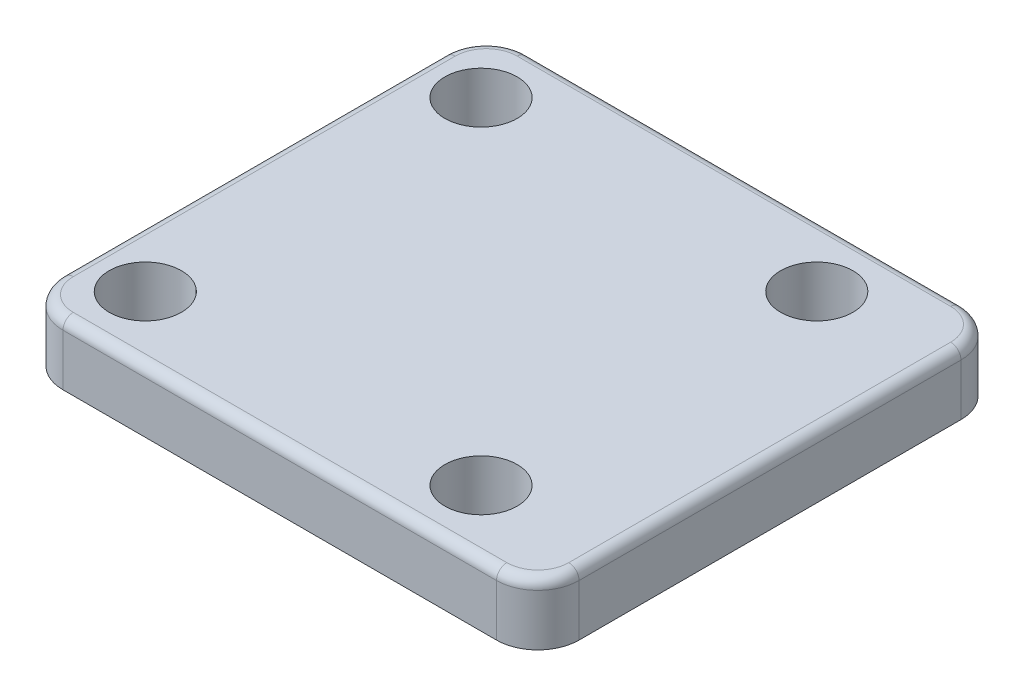
ISO-10303-21;
HEADER;
FILE_DESCRIPTION(('STEP AP214'),'2;1');
FILE_NAME('part.step','',(''),(''),'','','');
FILE_SCHEMA(('AUTOMOTIVE_DESIGN { 1 0 10303 214 1 1 1 1 }'));
ENDSEC;
DATA;
#1=APPLICATION_CONTEXT('core data for automotive mechanical design processes');
#2=APPLICATION_PROTOCOL_DEFINITION('international standard','automotive_design',2000,#1);
#3=PRODUCT_CONTEXT('',#1,'mechanical');
#4=PRODUCT('Part','Part','',(#3));
#5=PRODUCT_RELATED_PRODUCT_CATEGORY('part','',(#4));
#6=PRODUCT_DEFINITION_FORMATION('','',#4);
#7=PRODUCT_DEFINITION_CONTEXT('part definition',#1,'design');
#8=PRODUCT_DEFINITION('design','',#6,#7);
#9=PRODUCT_DEFINITION_SHAPE('','',#8);
#10=(LENGTH_UNIT() NAMED_UNIT(*) SI_UNIT(.MILLI.,.METRE.));
#11=(NAMED_UNIT(*) PLANE_ANGLE_UNIT() SI_UNIT($,.RADIAN.));
#12=(NAMED_UNIT(*) SI_UNIT($,.STERADIAN.) SOLID_ANGLE_UNIT());
#13=UNCERTAINTY_MEASURE_WITH_UNIT(LENGTH_MEASURE(1.E-05),#10,'distance_accuracy_value','');
#14=(GEOMETRIC_REPRESENTATION_CONTEXT(3) GLOBAL_UNCERTAINTY_ASSIGNED_CONTEXT((#13)) GLOBAL_UNIT_ASSIGNED_CONTEXT((#10,
#11,#12)) REPRESENTATION_CONTEXT('',''));
#15=CARTESIAN_POINT('',(0.,0.,0.));
#16=DIRECTION('',(0.,0.,1.));
#17=DIRECTION('',(1.,0.,0.));
#18=AXIS2_PLACEMENT_3D('',#15,#16,#17);
#19=CARTESIAN_POINT('',(-22.,6.,22.5));
#20=DIRECTION('',(1.,0.,0.));
#21=DIRECTION('',(0.,0.,-1.));
#22=AXIS2_PLACEMENT_3D('',#19,#20,#21);
#23=PLANE('',#22);
#24=DIRECTION('',(0.,-1.,0.));
#25=VECTOR('',#24,1.);
#26=CARTESIAN_POINT('',(-22.,6.,18.5));
#27=LINE('',#26,#25);
#28=CARTESIAN_POINT('',(-22.,0.,18.5));
#29=VERTEX_POINT('',#28);
#30=CARTESIAN_POINT('',(-22.,5.,18.5));
#31=VERTEX_POINT('',#30);
#32=EDGE_CURVE('E167',#29,#31,#27,.F.);
#33=ORIENTED_EDGE('',*,*,#32,.T.);
#34=DIRECTION('',(0.,0.,1.));
#35=VECTOR('',#34,1.);
#36=CARTESIAN_POINT('',(-22.,5.,-18.5));
#37=LINE('',#36,#35);
#38=CARTESIAN_POINT('',(-22.,5.,-18.5));
#39=VERTEX_POINT('',#38);
#40=EDGE_CURVE('E162',#31,#39,#37,.F.);
#41=ORIENTED_EDGE('',*,*,#40,.T.);
#42=DIRECTION('',(0.,-1.,0.));
#43=VECTOR('',#42,1.);
#44=CARTESIAN_POINT('',(-22.,6.,-18.5));
#45=LINE('',#44,#43);
#46=CARTESIAN_POINT('',(-22.,0.,-18.5));
#47=VERTEX_POINT('',#46);
#48=EDGE_CURVE('E155',#39,#47,#45,.T.);
#49=ORIENTED_EDGE('',*,*,#48,.T.);
#50=DIRECTION('',(0.,0.,1.));
#51=VECTOR('',#50,1.);
#52=CARTESIAN_POINT('',(-22.,0.,22.5));
#53=LINE('',#52,#51);
#54=EDGE_CURVE('E159',#47,#29,#53,.T.);
#55=ORIENTED_EDGE('',*,*,#54,.T.);
#56=EDGE_LOOP('',(#33,#41,#49,#55));
#57=FACE_BOUND('',#56,.T.);
#58=ADVANCED_FACE('F63',(#57),#23,.F.);
#59=CARTESIAN_POINT('',(28.,6.,22.5));
#60=DIRECTION('',(0.,0.,-1.));
#61=DIRECTION('',(-1.,0.,0.));
#62=AXIS2_PLACEMENT_3D('',#59,#60,#61);
#63=PLANE('',#62);
#64=DIRECTION('',(0.,-1.,0.));
#65=VECTOR('',#64,1.);
#66=CARTESIAN_POINT('',(24.,6.,22.5));
#67=LINE('',#66,#65);
#68=CARTESIAN_POINT('',(24.,0.,22.5));
#69=VERTEX_POINT('',#68);
#70=CARTESIAN_POINT('',(24.,5.,22.5));
#71=VERTEX_POINT('',#70);
#72=EDGE_CURVE('E233',#69,#71,#67,.F.);
#73=ORIENTED_EDGE('',*,*,#72,.T.);
#74=DIRECTION('',(1.,0.,0.));
#75=VECTOR('',#74,1.);
#76=CARTESIAN_POINT('',(-18.,5.,22.5));
#77=LINE('',#76,#75);
#78=CARTESIAN_POINT('',(-18.,5.,22.5));
#79=VERTEX_POINT('',#78);
#80=EDGE_CURVE('E269',#71,#79,#77,.F.);
#81=ORIENTED_EDGE('',*,*,#80,.T.);
#82=DIRECTION('',(0.,-1.,0.));
#83=VECTOR('',#82,1.);
#84=CARTESIAN_POINT('',(-18.,6.,22.5));
#85=LINE('',#84,#83);
#86=CARTESIAN_POINT('',(-18.,0.,22.5));
#87=VERTEX_POINT('',#86);
#88=EDGE_CURVE('E237',#79,#87,#85,.T.);
#89=ORIENTED_EDGE('',*,*,#88,.T.);
#90=DIRECTION('',(1.,0.,0.));
#91=VECTOR('',#90,1.);
#92=CARTESIAN_POINT('',(28.,0.,22.5));
#93=LINE('',#92,#91);
#94=EDGE_CURVE('E185',#87,#69,#93,.T.);
#95=ORIENTED_EDGE('',*,*,#94,.T.);
#96=EDGE_LOOP('',(#73,#81,#89,#95));
#97=FACE_BOUND('',#96,.T.);
#98=ADVANCED_FACE('F416',(#97),#63,.F.);
#99=CARTESIAN_POINT('',(28.,6.,22.5));
#100=DIRECTION('',(-1.,0.,0.));
#101=DIRECTION('',(0.,0.,1.));
#102=AXIS2_PLACEMENT_3D('',#99,#100,#101);
#103=PLANE('',#102);
#104=DIRECTION('',(0.,-1.,0.));
#105=VECTOR('',#104,1.);
#106=CARTESIAN_POINT('',(28.,6.,-18.5));
#107=LINE('',#106,#105);
#108=CARTESIAN_POINT('',(28.,0.,-18.5));
#109=VERTEX_POINT('',#108);
#110=CARTESIAN_POINT('',(28.,5.,-18.5));
#111=VERTEX_POINT('',#110);
#112=EDGE_CURVE('E230',#109,#111,#107,.F.);
#113=ORIENTED_EDGE('',*,*,#112,.T.);
#114=DIRECTION('',(0.,0.,-1.));
#115=VECTOR('',#114,1.);
#116=CARTESIAN_POINT('',(28.,5.,18.5));
#117=LINE('',#116,#115);
#118=CARTESIAN_POINT('',(28.,5.,18.5));
#119=VERTEX_POINT('',#118);
#120=EDGE_CURVE('E13',#111,#119,#117,.F.);
#121=ORIENTED_EDGE('',*,*,#120,.T.);
#122=DIRECTION('',(0.,-1.,0.));
#123=VECTOR('',#122,1.);
#124=CARTESIAN_POINT('',(28.,6.,18.5));
#125=LINE('',#124,#123);
#126=CARTESIAN_POINT('',(28.,0.,18.5));
#127=VERTEX_POINT('',#126);
#128=EDGE_CURVE('E227',#119,#127,#125,.T.);
#129=ORIENTED_EDGE('',*,*,#128,.T.);
#130=DIRECTION('',(0.,0.,-1.));
#131=VECTOR('',#130,1.);
#132=CARTESIAN_POINT('',(28.,0.,22.5));
#133=LINE('',#132,#131);
#134=EDGE_CURVE('E192',#127,#109,#133,.T.);
#135=ORIENTED_EDGE('',*,*,#134,.T.);
#136=EDGE_LOOP('',(#113,#121,#129,#135));
#137=FACE_BOUND('',#136,.T.);
#138=ADVANCED_FACE('F421',(#137),#103,.F.);
#139=CARTESIAN_POINT('',(28.,6.,-22.5));
#140=DIRECTION('',(0.,0.,1.));
#141=DIRECTION('',(1.,0.,0.));
#142=AXIS2_PLACEMENT_3D('',#139,#140,#141);
#143=PLANE('',#142);
#144=DIRECTION('',(0.,-1.,0.));
#145=VECTOR('',#144,1.);
#146=CARTESIAN_POINT('',(-18.,6.,-22.5));
#147=LINE('',#146,#145);
#148=CARTESIAN_POINT('',(-18.,0.,-22.5));
#149=VERTEX_POINT('',#148);
#150=CARTESIAN_POINT('',(-18.,5.,-22.5));
#151=VERTEX_POINT('',#150);
#152=EDGE_CURVE('E172',#149,#151,#147,.F.);
#153=ORIENTED_EDGE('',*,*,#152,.T.);
#154=DIRECTION('',(-1.,0.,0.));
#155=VECTOR('',#154,1.);
#156=CARTESIAN_POINT('',(24.,5.,-22.5));
#157=LINE('',#156,#155);
#158=CARTESIAN_POINT('',(24.,5.,-22.5));
#159=VERTEX_POINT('',#158);
#160=EDGE_CURVE('E88',#151,#159,#157,.F.);
#161=ORIENTED_EDGE('',*,*,#160,.T.);
#162=DIRECTION('',(0.,-1.,0.));
#163=VECTOR('',#162,1.);
#164=CARTESIAN_POINT('',(24.,6.,-22.5));
#165=LINE('',#164,#163);
#166=CARTESIAN_POINT('',(24.,0.,-22.5));
#167=VERTEX_POINT('',#166);
#168=EDGE_CURVE('E177',#159,#167,#165,.T.);
#169=ORIENTED_EDGE('',*,*,#168,.T.);
#170=DIRECTION('',(-1.,0.,0.));
#171=VECTOR('',#170,1.);
#172=CARTESIAN_POINT('',(28.,0.,-22.5));
#173=LINE('',#172,#171);
#174=EDGE_CURVE('E204',#167,#149,#173,.T.);
#175=ORIENTED_EDGE('',*,*,#174,.T.);
#176=EDGE_LOOP('',(#153,#161,#169,#175));
#177=FACE_BOUND('',#176,.T.);
#178=ADVANCED_FACE('F501',(#177),#143,.F.);
#179=CARTESIAN_POINT('',(0.,6.,0.));
#180=DIRECTION('',(0.,1.,0.));
#181=DIRECTION('',(0.,0.,1.));
#182=AXIS2_PLACEMENT_3D('',#179,#180,#181);
#183=PLANE('',#182);
#184=DIRECTION('',(1.,0.,0.));
#185=VECTOR('',#184,1.);
#186=CARTESIAN_POINT('',(24.,6.,21.5));
#187=LINE('',#186,#185);
#188=CARTESIAN_POINT('',(-18.,6.,21.5));
#189=VERTEX_POINT('',#188);
#190=CARTESIAN_POINT('',(24.,6.,21.5));
#191=VERTEX_POINT('',#190);
#192=EDGE_CURVE('E258',#189,#191,#187,.T.);
#193=ORIENTED_EDGE('',*,*,#192,.T.);
#194=CARTESIAN_POINT('',(24.,6.,18.5));
#195=DIRECTION('',(0.,1.,0.));
#196=DIRECTION('',(0.,0.,1.));
#197=AXIS2_PLACEMENT_3D('',#194,#195,#196);
#198=CIRCLE('',#197,3.);
#199=CARTESIAN_POINT('',(27.,6.,18.5));
#200=VERTEX_POINT('',#199);
#201=EDGE_CURVE('E261',#191,#200,#198,.T.);
#202=ORIENTED_EDGE('',*,*,#201,.T.);
#203=DIRECTION('',(0.,0.,-1.));
#204=VECTOR('',#203,1.);
#205=CARTESIAN_POINT('',(27.,6.,-18.5));
#206=LINE('',#205,#204);
#207=CARTESIAN_POINT('',(27.,6.,-18.5));
#208=VERTEX_POINT('',#207);
#209=EDGE_CURVE('E240',#200,#208,#206,.T.);
#210=ORIENTED_EDGE('',*,*,#209,.T.);
#211=CARTESIAN_POINT('',(24.,6.,-18.5));
#212=DIRECTION('',(0.,1.,0.));
#213=DIRECTION('',(0.,0.,1.));
#214=AXIS2_PLACEMENT_3D('',#211,#212,#213);
#215=CIRCLE('',#214,3.);
#216=CARTESIAN_POINT('',(24.,6.,-21.5));
#217=VERTEX_POINT('',#216);
#218=EDGE_CURVE('E243',#208,#217,#215,.T.);
#219=ORIENTED_EDGE('',*,*,#218,.T.);
#220=DIRECTION('',(-1.,0.,0.));
#221=VECTOR('',#220,1.);
#222=CARTESIAN_POINT('',(-18.,6.,-21.5));
#223=LINE('',#222,#221);
#224=CARTESIAN_POINT('',(-18.,6.,-21.5));
#225=VERTEX_POINT('',#224);
#226=EDGE_CURVE('E246',#217,#225,#223,.T.);
#227=ORIENTED_EDGE('',*,*,#226,.T.);
#228=CARTESIAN_POINT('',(-18.,6.,-18.5));
#229=DIRECTION('',(0.,1.,0.));
#230=DIRECTION('',(0.,0.,1.));
#231=AXIS2_PLACEMENT_3D('',#228,#229,#230);
#232=CIRCLE('',#231,3.);
#233=CARTESIAN_POINT('',(-21.,6.,-18.5));
#234=VERTEX_POINT('',#233);
#235=EDGE_CURVE('E249',#225,#234,#232,.T.);
#236=ORIENTED_EDGE('',*,*,#235,.T.);
#237=DIRECTION('',(0.,0.,1.));
#238=VECTOR('',#237,1.);
#239=CARTESIAN_POINT('',(-21.,6.,18.5));
#240=LINE('',#239,#238);
#241=CARTESIAN_POINT('',(-21.,6.,18.5));
#242=VERTEX_POINT('',#241);
#243=EDGE_CURVE('E252',#234,#242,#240,.T.);
#244=ORIENTED_EDGE('',*,*,#243,.T.);
#245=CARTESIAN_POINT('',(-18.,6.,18.5));
#246=DIRECTION('',(0.,1.,0.));
#247=DIRECTION('',(0.,0.,1.));
#248=AXIS2_PLACEMENT_3D('',#245,#246,#247);
#249=CIRCLE('',#248,3.);
#250=EDGE_CURVE('E255',#242,#189,#249,.T.);
#251=ORIENTED_EDGE('',*,*,#250,.T.);
#252=EDGE_LOOP('',(#193,#202,#210,#219,#227,#236,#244,#251));
#253=FACE_BOUND('',#252,.T.);
#254=CARTESIAN_POINT('',(-16.2634559672906,6.,16.2634559672906));
#255=DIRECTION('',(0.,-1.,0.));
#256=DIRECTION('',(1.,0.,0.));
#257=AXIS2_PLACEMENT_3D('',#254,#255,#256);
#258=CIRCLE('',#257,3.5);
#259=CARTESIAN_POINT('',(-12.7634559672906,6.,16.2634559672906));
#260=VERTEX_POINT('',#259);
#261=EDGE_CURVE('E333',#260,#260,#258,.T.);
#262=ORIENTED_EDGE('',*,*,#261,.T.);
#263=EDGE_LOOP('',(#262));
#264=FACE_BOUND('',#263,.T.);
#265=CARTESIAN_POINT('',(-16.2634559672906,6.,-16.2634559672906));
#266=DIRECTION('',(0.,-1.,0.));
#267=DIRECTION('',(0.,0.,1.));
#268=AXIS2_PLACEMENT_3D('',#265,#266,#267);
#269=CIRCLE('',#268,3.5);
#270=CARTESIAN_POINT('',(-16.2634559672906,6.,-12.7634559672906));
#271=VERTEX_POINT('',#270);
#272=EDGE_CURVE('E346',#271,#271,#269,.T.);
#273=ORIENTED_EDGE('',*,*,#272,.T.);
#274=EDGE_LOOP('',(#273));
#275=FACE_BOUND('',#274,.T.);
#276=CARTESIAN_POINT('',(16.2634559672907,6.,-16.2634559672904));
#277=DIRECTION('',(0.,-1.,0.));
#278=DIRECTION('',(-1.,0.,0.));
#279=AXIS2_PLACEMENT_3D('',#276,#277,#278);
#280=CIRCLE('',#279,3.5);
#281=CARTESIAN_POINT('',(12.7634559672907,6.,-16.2634559672905));
#282=VERTEX_POINT('',#281);
#283=EDGE_CURVE('E321',#282,#282,#280,.T.);
#284=ORIENTED_EDGE('',*,*,#283,.T.);
#285=EDGE_LOOP('',(#284));
#286=FACE_BOUND('',#285,.T.);
#287=CARTESIAN_POINT('',(16.2634559672906,6.,16.2634559672906));
#288=DIRECTION('',(0.,-1.,0.));
#289=DIRECTION('',(0.,0.,-1.));
#290=AXIS2_PLACEMENT_3D('',#287,#288,#289);
#291=CIRCLE('',#290,3.5);
#292=CARTESIAN_POINT('',(16.2634559672906,6.,12.7634559672906));
#293=VERTEX_POINT('',#292);
#294=EDGE_CURVE('E186',#293,#293,#291,.T.);
#295=ORIENTED_EDGE('',*,*,#294,.T.);
#296=EDGE_LOOP('',(#295));
#297=FACE_BOUND('',#296,.T.);
#298=ADVANCED_FACE('F361',(#253,#264,#275,#286,#297),#183,.T.);
#299=CARTESIAN_POINT('',(0.,0.,0.));
#300=DIRECTION('',(0.,1.,0.));
#301=DIRECTION('',(0.,0.,1.));
#302=AXIS2_PLACEMENT_3D('',#299,#300,#301);
#303=PLANE('',#302);
#304=CARTESIAN_POINT('',(-16.2634559672906,0.,16.2634559672906));
#305=DIRECTION('',(0.,-1.,0.));
#306=DIRECTION('',(1.,0.,0.));
#307=AXIS2_PLACEMENT_3D('',#304,#305,#306);
#308=CIRCLE('',#307,3.5);
#309=CARTESIAN_POINT('',(-12.7634559672906,0.,16.2634559672906));
#310=VERTEX_POINT('',#309);
#311=EDGE_CURVE('E339',#310,#310,#308,.T.);
#312=ORIENTED_EDGE('',*,*,#311,.F.);
#313=EDGE_LOOP('',(#312));
#314=FACE_BOUND('',#313,.T.);
#315=CARTESIAN_POINT('',(-16.2634559672906,0.,-16.2634559672906));
#316=DIRECTION('',(0.,-1.,0.));
#317=DIRECTION('',(0.,0.,1.));
#318=AXIS2_PLACEMENT_3D('',#315,#316,#317);
#319=CIRCLE('',#318,3.5);
#320=CARTESIAN_POINT('',(-16.2634559672906,0.,-12.7634559672906));
#321=VERTEX_POINT('',#320);
#322=EDGE_CURVE('E328',#321,#321,#319,.T.);
#323=ORIENTED_EDGE('',*,*,#322,.F.);
#324=EDGE_LOOP('',(#323));
#325=FACE_BOUND('',#324,.T.);
#326=CARTESIAN_POINT('',(16.2634559672907,0.,-16.2634559672904));
#327=DIRECTION('',(0.,-1.,0.));
#328=DIRECTION('',(-1.,0.,0.));
#329=AXIS2_PLACEMENT_3D('',#326,#327,#328);
#330=CIRCLE('',#329,3.5);
#331=CARTESIAN_POINT('',(12.7634559672907,0.,-16.2634559672905));
#332=VERTEX_POINT('',#331);
#333=EDGE_CURVE('E314',#332,#332,#330,.T.);
#334=ORIENTED_EDGE('',*,*,#333,.F.);
#335=EDGE_LOOP('',(#334));
#336=FACE_BOUND('',#335,.T.);
#337=CARTESIAN_POINT('',(16.2634559672906,0.,16.2634559672906));
#338=DIRECTION('',(0.,-1.,0.));
#339=DIRECTION('',(0.,0.,-1.));
#340=AXIS2_PLACEMENT_3D('',#337,#338,#339);
#341=CIRCLE('',#340,3.5);
#342=CARTESIAN_POINT('',(16.2634559672906,0.,12.7634559672906));
#343=VERTEX_POINT('',#342);
#344=EDGE_CURVE('E195',#343,#343,#341,.T.);
#345=ORIENTED_EDGE('',*,*,#344,.F.);
#346=EDGE_LOOP('',(#345));
#347=FACE_BOUND('',#346,.T.);
#348=CARTESIAN_POINT('',(0.,0.,0.));
#349=DIRECTION('',(0.,-1.,0.));
#350=DIRECTION('',(0.,0.,-1.));
#351=AXIS2_PLACEMENT_3D('',#348,#349,#350);
#352=CIRCLE('',#351,16.);
#353=CARTESIAN_POINT('',(0.,0.,-16.));
#354=VERTEX_POINT('',#353);
#355=EDGE_CURVE('E198',#354,#354,#352,.T.);
#356=ORIENTED_EDGE('',*,*,#355,.F.);
#357=EDGE_LOOP('',(#356));
#358=FACE_BOUND('',#357,.T.);
#359=ORIENTED_EDGE('',*,*,#54,.F.);
#360=CARTESIAN_POINT('',(-18.,0.,-18.5));
#361=DIRECTION('',(0.,1.,0.));
#362=DIRECTION('',(0.,0.,1.));
#363=AXIS2_PLACEMENT_3D('',#360,#361,#362);
#364=CIRCLE('',#363,4.);
#365=EDGE_CURVE('E170',#47,#149,#364,.F.);
#366=ORIENTED_EDGE('',*,*,#365,.T.);
#367=ORIENTED_EDGE('',*,*,#174,.F.);
#368=CARTESIAN_POINT('',(24.,0.,-18.5));
#369=DIRECTION('',(0.,1.,0.));
#370=DIRECTION('',(0.,0.,1.));
#371=AXIS2_PLACEMENT_3D('',#368,#369,#370);
#372=CIRCLE('',#371,4.);
#373=EDGE_CURVE('E178',#167,#109,#372,.F.);
#374=ORIENTED_EDGE('',*,*,#373,.T.);
#375=ORIENTED_EDGE('',*,*,#134,.F.);
#376=CARTESIAN_POINT('',(24.,0.,18.5));
#377=DIRECTION('',(0.,1.,0.));
#378=DIRECTION('',(0.,0.,1.));
#379=AXIS2_PLACEMENT_3D('',#376,#377,#378);
#380=CIRCLE('',#379,4.);
#381=EDGE_CURVE('E166',#127,#69,#380,.F.);
#382=ORIENTED_EDGE('',*,*,#381,.T.);
#383=ORIENTED_EDGE('',*,*,#94,.F.);
#384=CARTESIAN_POINT('',(-18.,0.,18.5));
#385=DIRECTION('',(0.,1.,0.));
#386=DIRECTION('',(0.,0.,1.));
#387=AXIS2_PLACEMENT_3D('',#384,#385,#386);
#388=CIRCLE('',#387,4.);
#389=EDGE_CURVE('E183',#87,#29,#388,.F.);
#390=ORIENTED_EDGE('',*,*,#389,.T.);
#391=EDGE_LOOP('',(#359,#366,#367,#374,#375,#382,#383,#390));
#392=FACE_BOUND('',#391,.T.);
#393=ADVANCED_FACE('F180',(#314,#325,#336,#347,#358,#392),#303,.F.);
#394=CARTESIAN_POINT('',(0.,-2.,0.));
#395=DIRECTION('',(0.,1.,0.));
#396=DIRECTION('',(0.,0.,1.));
#397=AXIS2_PLACEMENT_3D('',#394,#395,#396);
#398=CYLINDRICAL_SURFACE('',#397,16.);
#399=CARTESIAN_POINT('',(0.,-0.999999999999999,0.));
#400=DIRECTION('',(0.,-1.,0.));
#401=DIRECTION('',(0.,0.,-1.));
#402=AXIS2_PLACEMENT_3D('',#399,#400,#401);
#403=CIRCLE('',#402,16.);
#404=CARTESIAN_POINT('',(0.,-0.999999999999999,-16.));
#405=VERTEX_POINT('',#404);
#406=EDGE_CURVE('E211',#405,#405,#403,.F.);
#407=ORIENTED_EDGE('',*,*,#406,.T.);
#408=EDGE_LOOP('',(#407));
#409=FACE_BOUND('',#408,.T.);
#410=ORIENTED_EDGE('',*,*,#355,.T.);
#411=EDGE_LOOP('',(#410));
#412=FACE_BOUND('',#411,.T.);
#413=ADVANCED_FACE('F360',(#409,#412),#398,.T.);
#414=CARTESIAN_POINT('',(0.,-2.,0.));
#415=DIRECTION('',(0.,-1.,0.));
#416=DIRECTION('',(0.,0.,-1.));
#417=AXIS2_PLACEMENT_3D('',#414,#415,#416);
#418=PLANE('',#417);
#419=CARTESIAN_POINT('',(0.,-2.,0.));
#420=DIRECTION('',(0.,-1.,0.));
#421=DIRECTION('',(0.,0.,-1.));
#422=AXIS2_PLACEMENT_3D('',#419,#420,#421);
#423=CIRCLE('',#422,15.);
#424=CARTESIAN_POINT('',(0.,-2.,-15.));
#425=VERTEX_POINT('',#424);
#426=EDGE_CURVE('E207',#425,#425,#423,.T.);
#427=ORIENTED_EDGE('',*,*,#426,.T.);
#428=EDGE_LOOP('',(#427));
#429=FACE_BOUND('',#428,.T.);
#430=ADVANCED_FACE('F405',(#429),#418,.T.);
#431=CARTESIAN_POINT('',(0.,-2.,0.));
#432=DIRECTION('',(0.,1.,0.));
#433=DIRECTION('',(0.,0.,1.));
#434=AXIS2_PLACEMENT_3D('',#431,#432,#433);
#435=CONICAL_SURFACE('',#434,15.,0.785398163397448);
#436=ORIENTED_EDGE('',*,*,#406,.F.);
#437=EDGE_LOOP('',(#436));
#438=FACE_BOUND('',#437,.T.);
#439=ORIENTED_EDGE('',*,*,#426,.F.);
#440=EDGE_LOOP('',(#439));
#441=FACE_BOUND('',#440,.T.);
#442=ADVANCED_FACE('F411',(#438,#441),#435,.T.);
#443=CARTESIAN_POINT('',(16.2634559672906,6.,16.2634559672906));
#444=DIRECTION('',(0.,-1.,0.));
#445=DIRECTION('',(0.,0.,-1.));
#446=AXIS2_PLACEMENT_3D('',#443,#444,#445);
#447=CYLINDRICAL_SURFACE('',#446,3.5);
#448=ORIENTED_EDGE('',*,*,#294,.F.);
#449=EDGE_LOOP('',(#448));
#450=FACE_BOUND('',#449,.T.);
#451=ORIENTED_EDGE('',*,*,#344,.T.);
#452=EDGE_LOOP('',(#451));
#453=FACE_BOUND('',#452,.T.);
#454=ADVANCED_FACE('F431',(#450,#453),#447,.F.);
#455=CARTESIAN_POINT('',(16.2634559672907,6.,-16.2634559672904));
#456=DIRECTION('',(0.,-1.,0.));
#457=DIRECTION('',(0.,0.,-1.));
#458=AXIS2_PLACEMENT_3D('',#455,#456,#457);
#459=CYLINDRICAL_SURFACE('',#458,3.5);
#460=ORIENTED_EDGE('',*,*,#283,.F.);
#461=EDGE_LOOP('',(#460));
#462=FACE_BOUND('',#461,.T.);
#463=ORIENTED_EDGE('',*,*,#333,.T.);
#464=EDGE_LOOP('',(#463));
#465=FACE_BOUND('',#464,.T.);
#466=ADVANCED_FACE('F510',(#462,#465),#459,.F.);
#467=CARTESIAN_POINT('',(-16.2634559672906,6.,-16.2634559672906));
#468=DIRECTION('',(0.,-1.,0.));
#469=DIRECTION('',(0.,0.,-1.));
#470=AXIS2_PLACEMENT_3D('',#467,#468,#469);
#471=CYLINDRICAL_SURFACE('',#470,3.5);
#472=ORIENTED_EDGE('',*,*,#272,.F.);
#473=EDGE_LOOP('',(#472));
#474=FACE_BOUND('',#473,.T.);
#475=ORIENTED_EDGE('',*,*,#322,.T.);
#476=EDGE_LOOP('',(#475));
#477=FACE_BOUND('',#476,.T.);
#478=ADVANCED_FACE('F356',(#474,#477),#471,.F.);
#479=CARTESIAN_POINT('',(-16.2634559672906,6.,16.2634559672906));
#480=DIRECTION('',(0.,-1.,0.));
#481=DIRECTION('',(0.,0.,-1.));
#482=AXIS2_PLACEMENT_3D('',#479,#480,#481);
#483=CYLINDRICAL_SURFACE('',#482,3.5);
#484=ORIENTED_EDGE('',*,*,#261,.F.);
#485=EDGE_LOOP('',(#484));
#486=FACE_BOUND('',#485,.T.);
#487=ORIENTED_EDGE('',*,*,#311,.T.);
#488=EDGE_LOOP('',(#487));
#489=FACE_BOUND('',#488,.T.);
#490=ADVANCED_FACE('F436',(#486,#489),#483,.F.);
#491=CARTESIAN_POINT('',(-18.,6.,-18.5));
#492=DIRECTION('',(0.,-1.,0.));
#493=DIRECTION('',(0.,0.,-1.));
#494=AXIS2_PLACEMENT_3D('',#491,#492,#493);
#495=CYLINDRICAL_SURFACE('',#494,4.);
#496=ORIENTED_EDGE('',*,*,#48,.F.);
#497=CARTESIAN_POINT('',(-18.,5.,-18.5));
#498=DIRECTION('',(0.,1.,0.));
#499=DIRECTION('',(0.,0.,1.));
#500=AXIS2_PLACEMENT_3D('',#497,#498,#499);
#501=CIRCLE('',#500,4.);
#502=EDGE_CURVE('E277',#39,#151,#501,.F.);
#503=ORIENTED_EDGE('',*,*,#502,.T.);
#504=ORIENTED_EDGE('',*,*,#152,.F.);
#505=ORIENTED_EDGE('',*,*,#365,.F.);
#506=EDGE_LOOP('',(#496,#503,#504,#505));
#507=FACE_BOUND('',#506,.T.);
#508=ADVANCED_FACE('F171',(#507),#495,.T.);
#509=CARTESIAN_POINT('',(24.,6.,-18.5));
#510=DIRECTION('',(0.,-1.,0.));
#511=DIRECTION('',(0.,0.,-1.));
#512=AXIS2_PLACEMENT_3D('',#509,#510,#511);
#513=CYLINDRICAL_SURFACE('',#512,4.);
#514=ORIENTED_EDGE('',*,*,#168,.F.);
#515=CARTESIAN_POINT('',(24.,5.,-18.5));
#516=DIRECTION('',(0.,1.,0.));
#517=DIRECTION('',(0.,0.,1.));
#518=AXIS2_PLACEMENT_3D('',#515,#516,#517);
#519=CIRCLE('',#518,4.);
#520=EDGE_CURVE('E73',#159,#111,#519,.F.);
#521=ORIENTED_EDGE('',*,*,#520,.T.);
#522=ORIENTED_EDGE('',*,*,#112,.F.);
#523=ORIENTED_EDGE('',*,*,#373,.F.);
#524=EDGE_LOOP('',(#514,#521,#522,#523));
#525=FACE_BOUND('',#524,.T.);
#526=ADVANCED_FACE('F435',(#525),#513,.T.);
#527=CARTESIAN_POINT('',(-18.,6.,18.5));
#528=DIRECTION('',(0.,-1.,0.));
#529=DIRECTION('',(0.,0.,-1.));
#530=AXIS2_PLACEMENT_3D('',#527,#528,#529);
#531=CYLINDRICAL_SURFACE('',#530,4.);
#532=ORIENTED_EDGE('',*,*,#88,.F.);
#533=CARTESIAN_POINT('',(-18.,5.,18.5));
#534=DIRECTION('',(0.,1.,0.));
#535=DIRECTION('',(0.,0.,1.));
#536=AXIS2_PLACEMENT_3D('',#533,#534,#535);
#537=CIRCLE('',#536,4.);
#538=EDGE_CURVE('E272',#79,#31,#537,.F.);
#539=ORIENTED_EDGE('',*,*,#538,.T.);
#540=ORIENTED_EDGE('',*,*,#32,.F.);
#541=ORIENTED_EDGE('',*,*,#389,.F.);
#542=EDGE_LOOP('',(#532,#539,#540,#541));
#543=FACE_BOUND('',#542,.T.);
#544=ADVANCED_FACE('F439',(#543),#531,.T.);
#545=CARTESIAN_POINT('',(24.,6.,18.5));
#546=DIRECTION('',(0.,-1.,0.));
#547=DIRECTION('',(0.,0.,-1.));
#548=AXIS2_PLACEMENT_3D('',#545,#546,#547);
#549=CYLINDRICAL_SURFACE('',#548,4.);
#550=ORIENTED_EDGE('',*,*,#128,.F.);
#551=CARTESIAN_POINT('',(24.,5.,18.5));
#552=DIRECTION('',(0.,1.,0.));
#553=DIRECTION('',(0.,0.,1.));
#554=AXIS2_PLACEMENT_3D('',#551,#552,#553);
#555=CIRCLE('',#554,4.);
#556=EDGE_CURVE('E265',#119,#71,#555,.F.);
#557=ORIENTED_EDGE('',*,*,#556,.T.);
#558=ORIENTED_EDGE('',*,*,#72,.F.);
#559=ORIENTED_EDGE('',*,*,#381,.F.);
#560=EDGE_LOOP('',(#550,#557,#558,#559));
#561=FACE_BOUND('',#560,.T.);
#562=ADVANCED_FACE('F442',(#561),#549,.T.);
#563=CARTESIAN_POINT('',(-18.,5.,-18.5));
#564=DIRECTION('',(0.,1.,0.));
#565=DIRECTION('',(0.,0.,1.));
#566=AXIS2_PLACEMENT_3D('',#563,#564,#565);
#567=TOROIDAL_SURFACE('',#566,3.,1.);
#568=CARTESIAN_POINT('',(-18.,5.,-21.5));
#569=DIRECTION('',(1.,0.,0.));
#570=DIRECTION('',(0.,0.,-1.));
#571=AXIS2_PLACEMENT_3D('',#568,#569,#570);
#572=CIRCLE('',#571,1.);
#573=EDGE_CURVE('E305',#151,#225,#572,.T.);
#574=ORIENTED_EDGE('',*,*,#573,.F.);
#575=ORIENTED_EDGE('',*,*,#502,.F.);
#576=CARTESIAN_POINT('',(-21.,5.,-18.5));
#577=DIRECTION('',(0.,0.,1.));
#578=DIRECTION('',(1.,0.,0.));
#579=AXIS2_PLACEMENT_3D('',#576,#577,#578);
#580=CIRCLE('',#579,1.);
#581=EDGE_CURVE('E67',#234,#39,#580,.T.);
#582=ORIENTED_EDGE('',*,*,#581,.F.);
#583=ORIENTED_EDGE('',*,*,#235,.F.);
#584=EDGE_LOOP('',(#574,#575,#582,#583));
#585=FACE_BOUND('',#584,.T.);
#586=ADVANCED_FACE('F65',(#585),#567,.T.);
#587=CARTESIAN_POINT('',(-21.,5.,0.));
#588=DIRECTION('',(0.,0.,-1.));
#589=DIRECTION('',(-1.,0.,0.));
#590=AXIS2_PLACEMENT_3D('',#587,#588,#589);
#591=CYLINDRICAL_SURFACE('',#590,1.);
#592=ORIENTED_EDGE('',*,*,#581,.T.);
#593=ORIENTED_EDGE('',*,*,#40,.F.);
#594=CARTESIAN_POINT('',(-21.,5.,18.5));
#595=DIRECTION('',(0.,0.,1.));
#596=DIRECTION('',(1.,0.,0.));
#597=AXIS2_PLACEMENT_3D('',#594,#595,#596);
#598=CIRCLE('',#597,1.);
#599=EDGE_CURVE('E302',#242,#31,#598,.T.);
#600=ORIENTED_EDGE('',*,*,#599,.F.);
#601=ORIENTED_EDGE('',*,*,#243,.F.);
#602=EDGE_LOOP('',(#592,#593,#600,#601));
#603=FACE_BOUND('',#602,.T.);
#604=ADVANCED_FACE('F469',(#603),#591,.T.);
#605=CARTESIAN_POINT('',(0.,5.,-21.5));
#606=DIRECTION('',(1.,0.,0.));
#607=DIRECTION('',(0.,0.,-1.));
#608=AXIS2_PLACEMENT_3D('',#605,#606,#607);
#609=CYLINDRICAL_SURFACE('',#608,1.);
#610=ORIENTED_EDGE('',*,*,#573,.T.);
#611=ORIENTED_EDGE('',*,*,#226,.F.);
#612=CARTESIAN_POINT('',(24.,5.,-21.5));
#613=DIRECTION('',(1.,0.,0.));
#614=DIRECTION('',(0.,0.,-1.));
#615=AXIS2_PLACEMENT_3D('',#612,#613,#614);
#616=CIRCLE('',#615,1.);
#617=EDGE_CURVE('E298',#159,#217,#616,.T.);
#618=ORIENTED_EDGE('',*,*,#617,.F.);
#619=ORIENTED_EDGE('',*,*,#160,.F.);
#620=EDGE_LOOP('',(#610,#611,#618,#619));
#621=FACE_BOUND('',#620,.T.);
#622=ADVANCED_FACE('F466',(#621),#609,.T.);
#623=CARTESIAN_POINT('',(-18.,5.,18.5));
#624=DIRECTION('',(0.,1.,0.));
#625=DIRECTION('',(0.,0.,1.));
#626=AXIS2_PLACEMENT_3D('',#623,#624,#625);
#627=TOROIDAL_SURFACE('',#626,3.,1.);
#628=ORIENTED_EDGE('',*,*,#599,.T.);
#629=ORIENTED_EDGE('',*,*,#538,.F.);
#630=CARTESIAN_POINT('',(-18.,5.,21.5));
#631=DIRECTION('',(1.,0.,0.));
#632=DIRECTION('',(0.,0.,-1.));
#633=AXIS2_PLACEMENT_3D('',#630,#631,#632);
#634=CIRCLE('',#633,1.);
#635=EDGE_CURVE('E294',#189,#79,#634,.T.);
#636=ORIENTED_EDGE('',*,*,#635,.F.);
#637=ORIENTED_EDGE('',*,*,#250,.F.);
#638=EDGE_LOOP('',(#628,#629,#636,#637));
#639=FACE_BOUND('',#638,.T.);
#640=ADVANCED_FACE('F462',(#639),#627,.T.);
#641=CARTESIAN_POINT('',(24.,5.,-18.5));
#642=DIRECTION('',(0.,1.,0.));
#643=DIRECTION('',(0.,0.,1.));
#644=AXIS2_PLACEMENT_3D('',#641,#642,#643);
#645=TOROIDAL_SURFACE('',#644,3.,1.);
#646=ORIENTED_EDGE('',*,*,#617,.T.);
#647=ORIENTED_EDGE('',*,*,#218,.F.);
#648=CARTESIAN_POINT('',(27.,5.,-18.5));
#649=DIRECTION('',(0.,0.,1.));
#650=DIRECTION('',(1.,0.,0.));
#651=AXIS2_PLACEMENT_3D('',#648,#649,#650);
#652=CIRCLE('',#651,1.);
#653=EDGE_CURVE('E290',#111,#208,#652,.T.);
#654=ORIENTED_EDGE('',*,*,#653,.F.);
#655=ORIENTED_EDGE('',*,*,#520,.F.);
#656=EDGE_LOOP('',(#646,#647,#654,#655));
#657=FACE_BOUND('',#656,.T.);
#658=ADVANCED_FACE('F458',(#657),#645,.T.);
#659=CARTESIAN_POINT('',(0.,5.,21.5));
#660=DIRECTION('',(-1.,0.,0.));
#661=DIRECTION('',(0.,0.,1.));
#662=AXIS2_PLACEMENT_3D('',#659,#660,#661);
#663=CYLINDRICAL_SURFACE('',#662,1.);
#664=ORIENTED_EDGE('',*,*,#635,.T.);
#665=ORIENTED_EDGE('',*,*,#80,.F.);
#666=CARTESIAN_POINT('',(24.,5.,21.5));
#667=DIRECTION('',(1.,0.,0.));
#668=DIRECTION('',(0.,0.,-1.));
#669=AXIS2_PLACEMENT_3D('',#666,#667,#668);
#670=CIRCLE('',#669,1.);
#671=EDGE_CURVE('E287',#191,#71,#670,.T.);
#672=ORIENTED_EDGE('',*,*,#671,.F.);
#673=ORIENTED_EDGE('',*,*,#192,.F.);
#674=EDGE_LOOP('',(#664,#665,#672,#673));
#675=FACE_BOUND('',#674,.T.);
#676=ADVANCED_FACE('F454',(#675),#663,.T.);
#677=CARTESIAN_POINT('',(27.,5.,0.));
#678=DIRECTION('',(0.,0.,1.));
#679=DIRECTION('',(1.,0.,0.));
#680=AXIS2_PLACEMENT_3D('',#677,#678,#679);
#681=CYLINDRICAL_SURFACE('',#680,1.);
#682=ORIENTED_EDGE('',*,*,#653,.T.);
#683=ORIENTED_EDGE('',*,*,#209,.F.);
#684=CARTESIAN_POINT('',(27.,5.,18.5));
#685=DIRECTION('',(0.,0.,1.));
#686=DIRECTION('',(1.,0.,0.));
#687=AXIS2_PLACEMENT_3D('',#684,#685,#686);
#688=CIRCLE('',#687,1.);
#689=EDGE_CURVE('E284',#119,#200,#688,.T.);
#690=ORIENTED_EDGE('',*,*,#689,.F.);
#691=ORIENTED_EDGE('',*,*,#120,.F.);
#692=EDGE_LOOP('',(#682,#683,#690,#691));
#693=FACE_BOUND('',#692,.T.);
#694=ADVANCED_FACE('F450',(#693),#681,.T.);
#695=CARTESIAN_POINT('',(24.,5.,18.5));
#696=DIRECTION('',(0.,1.,0.));
#697=DIRECTION('',(0.,0.,1.));
#698=AXIS2_PLACEMENT_3D('',#695,#696,#697);
#699=TOROIDAL_SURFACE('',#698,3.,1.);
#700=ORIENTED_EDGE('',*,*,#671,.T.);
#701=ORIENTED_EDGE('',*,*,#556,.F.);
#702=ORIENTED_EDGE('',*,*,#689,.T.);
#703=ORIENTED_EDGE('',*,*,#201,.F.);
#704=EDGE_LOOP('',(#700,#701,#702,#703));
#705=FACE_BOUND('',#704,.T.);
#706=ADVANCED_FACE('F447',(#705),#699,.T.);
#707=CLOSED_SHELL('',(#58,#98,#138,#178,#298,#393,#413,#430,#442,#454,#466,#478,#490,#508,#526,
#544,#562,#586,#604,#622,#640,#658,#676,#694,#706));
#708=MANIFOLD_SOLID_BREP('B2',#707);
#709=ADVANCED_BREP_SHAPE_REPRESENTATION('',(#18,#708),#14);
#710=SHAPE_DEFINITION_REPRESENTATION(#9,#709);
ENDSEC;
END-ISO-10303-21;
